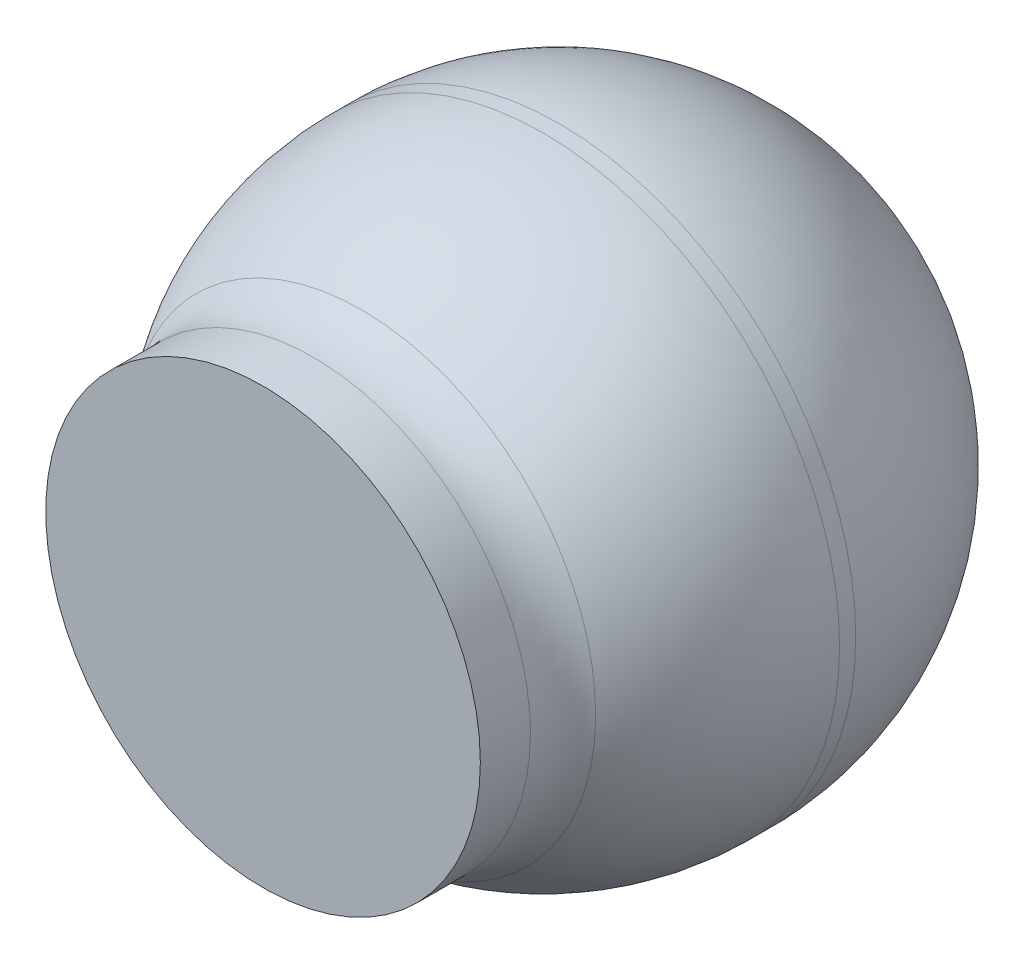
ISO-10303-21;
HEADER;
FILE_DESCRIPTION(('STEP AP214'),'2;1');
FILE_NAME('part.step','',(''),(''),'','','');
FILE_SCHEMA(('AUTOMOTIVE_DESIGN { 1 0 10303 214 1 1 1 1 }'));
ENDSEC;
DATA;
#1=APPLICATION_CONTEXT('core data for automotive mechanical design processes');
#2=APPLICATION_PROTOCOL_DEFINITION('international standard','automotive_design',2000,#1);
#3=PRODUCT_CONTEXT('',#1,'mechanical');
#4=PRODUCT('Part','Part','',(#3));
#5=PRODUCT_RELATED_PRODUCT_CATEGORY('part','',(#4));
#6=PRODUCT_DEFINITION_FORMATION('','',#4);
#7=PRODUCT_DEFINITION_CONTEXT('part definition',#1,'design');
#8=PRODUCT_DEFINITION('design','',#6,#7);
#9=PRODUCT_DEFINITION_SHAPE('','',#8);
#10=(LENGTH_UNIT() NAMED_UNIT(*) SI_UNIT(.MILLI.,.METRE.));
#11=(NAMED_UNIT(*) PLANE_ANGLE_UNIT() SI_UNIT($,.RADIAN.));
#12=(NAMED_UNIT(*) SI_UNIT($,.STERADIAN.) SOLID_ANGLE_UNIT());
#13=UNCERTAINTY_MEASURE_WITH_UNIT(LENGTH_MEASURE(1.E-05),#10,'distance_accuracy_value','');
#14=(GEOMETRIC_REPRESENTATION_CONTEXT(3) GLOBAL_UNCERTAINTY_ASSIGNED_CONTEXT((#13)) GLOBAL_UNIT_ASSIGNED_CONTEXT((#10,
#11,#12)) REPRESENTATION_CONTEXT('',''));
#15=CARTESIAN_POINT('',(0.,0.,0.));
#16=DIRECTION('',(0.,0.,1.));
#17=DIRECTION('',(1.,0.,0.));
#18=AXIS2_PLACEMENT_3D('',#15,#16,#17);
#19=CARTESIAN_POINT('',(-5.642919922269,-7.861349291452,10.006534503384));
#20=DIRECTION('',(0.,0.,-1.));
#21=DIRECTION('',(-1.,0.,0.));
#22=AXIS2_PLACEMENT_3D('',#19,#20,#21);
#23=PLANE('',#22);
#24=CARTESIAN_POINT('',(-5.642919922269,-7.861349291452,10.006534503384));
#25=DIRECTION('',(0.,0.,1.));
#26=DIRECTION('',(1.,0.,0.));
#27=AXIS2_PLACEMENT_3D('',#24,#25,#26);
#28=CIRCLE('',#27,0.275);
#29=CARTESIAN_POINT('',(-5.367919922269,-7.861349291452,10.006534503384));
#30=VERTEX_POINT('',#29);
#31=EDGE_CURVE('E20',#30,#30,#28,.F.);
#32=ORIENTED_EDGE('',*,*,#31,.F.);
#33=EDGE_LOOP('',(#32));
#34=FACE_BOUND('',#33,.T.);
#35=ADVANCED_FACE('F17',(#34),#23,.F.);
#36=CARTESIAN_POINT('',(-5.642919922269,-7.861349291452,9.906534503384));
#37=DIRECTION('',(0.,0.,1.));
#38=DIRECTION('',(1.,0.,0.));
#39=AXIS2_PLACEMENT_3D('',#36,#37,#38);
#40=CYLINDRICAL_SURFACE('',#39,0.275);
#41=CARTESIAN_POINT('',(-5.642919922269,-7.861349291452,9.943180457728));
#42=DIRECTION('',(0.,0.,-1.));
#43=DIRECTION('',(0.996700902337582,0.081162252799247,0.));
#44=AXIS2_PLACEMENT_3D('',#41,#42,#43);
#45=CIRCLE('',#44,0.275);
#46=CARTESIAN_POINT('',(-5.36882717412616,-7.83902967193221,9.943180457728));
#47=VERTEX_POINT('',#46);
#48=EDGE_CURVE('E65',#47,#47,#45,.F.);
#49=ORIENTED_EDGE('',*,*,#48,.T.);
#50=EDGE_LOOP('',(#49));
#51=FACE_BOUND('',#50,.T.);
#52=ORIENTED_EDGE('',*,*,#31,.T.);
#53=EDGE_LOOP('',(#52));
#54=FACE_BOUND('',#53,.T.);
#55=ADVANCED_FACE('F62',(#51,#54),#40,.T.);
#56=CARTESIAN_POINT('',(-5.642919922269,-7.861349291452,9.943180457728));
#57=DIRECTION('',(0.,0.,-1.));
#58=DIRECTION('',(0.996700902337583,0.0811622527992448,0.));
#59=AXIS2_PLACEMENT_3D('',#56,#57,#58);
#60=TOROIDAL_SURFACE('',#59,0.375,0.1);
#61=ORIENTED_EDGE('',*,*,#48,.F.);
#62=EDGE_LOOP('',(#61));
#63=FACE_BOUND('',#62,.T.);
#64=CARTESIAN_POINT('',(-5.642919922269,-7.861349291452,9.881744931236));
#65=DIRECTION('',(0.,0.,-1.));
#66=DIRECTION('',(-0.996700902337598,-0.081162252799062,0.));
#67=AXIS2_PLACEMENT_3D('',#64,#65,#66);
#68=CIRCLE('',#67,0.296097046412666);
#69=CARTESIAN_POINT('',(-5.938040115608,-7.885381194786,9.881744931236));
#70=VERTEX_POINT('',#69);
#71=EDGE_CURVE('E39',#70,#70,#68,.T.);
#72=ORIENTED_EDGE('',*,*,#71,.F.);
#73=EDGE_LOOP('',(#72));
#74=FACE_BOUND('',#73,.T.);
#75=ADVANCED_FACE('F57',(#63,#74),#60,.F.);
#76=CARTESIAN_POINT('',(-6.016682760645,-7.891785136252,9.651976062157));
#77=CARTESIAN_POINT('',(-6.016682760645,-7.891785136252,9.701461392103));
#78=CARTESIAN_POINT('',(-6.008526217348,-7.891120941579,9.750947004335));
#79=CARTESIAN_POINT('',(-5.992207085349,-7.889792059952,9.798626332798));
#80=CARTESIAN_POINT('',(-5.968341390838,-7.887848654938,9.842699544317));
#81=CARTESIAN_POINT('',(-5.938040115608,-7.885381194786,9.881744931236));
#82=(BOUNDED_CURVE() B_SPLINE_CURVE(5,(#76,#77,#78,#79,#80,#81),.UNSPECIFIED.,.F.,
.F.) B_SPLINE_CURVE_WITH_KNOTS((6,6),(0.,0.661568582165),
.UNSPECIFIED.) CURVE() GEOMETRIC_REPRESENTATION_ITEM() RATIONAL_B_SPLINE_CURVE((1.,1.,1.,1.,1.,1.)) REPRESENTATION_ITEM(''));
#83=CARTESIAN_POINT('',(-5.642919922269,-7.861349291452,9.651976062157));
#84=DIRECTION('',(0.,0.,-1.));
#85=AXIS1_PLACEMENT('',#83,#84);
#86=SURFACE_OF_REVOLUTION('',#82,#85);
#87=CARTESIAN_POINT('',(-5.642919922269,-7.861349291452,9.651976062157));
#88=DIRECTION('',(0.,0.,1.));
#89=DIRECTION('',(1.,0.,0.));
#90=AXIS2_PLACEMENT_3D('',#87,#88,#89);
#91=CIRCLE('',#90,0.375);
#92=CARTESIAN_POINT('',(-5.267919922269,-7.861349291452,9.651976062157));
#93=VERTEX_POINT('',#92);
#94=EDGE_CURVE('E36',#93,#93,#91,.F.);
#95=ORIENTED_EDGE('',*,*,#94,.F.);
#96=EDGE_LOOP('',(#95));
#97=FACE_BOUND('',#96,.T.);
#98=ORIENTED_EDGE('',*,*,#71,.T.);
#99=EDGE_LOOP('',(#98));
#100=FACE_BOUND('',#99,.T.);
#101=ADVANCED_FACE('F53',(#97,#100),#86,.F.);
#102=CARTESIAN_POINT('',(-5.642919922269,-7.861349291452,9.256534503384));
#103=DIRECTION('',(0.,0.,1.));
#104=DIRECTION('',(1.,0.,0.));
#105=AXIS2_PLACEMENT_3D('',#102,#103,#104);
#106=CYLINDRICAL_SURFACE('',#105,0.375);
#107=CARTESIAN_POINT('',(-5.642919922269,-7.861349291452,9.631534503384));
#108=DIRECTION('',(0.,0.,-1.));
#109=DIRECTION('',(0.0811622527992357,-0.996700902337583,0.));
#110=AXIS2_PLACEMENT_3D('',#107,#108,#109);
#111=CIRCLE('',#110,0.375);
#112=CARTESIAN_POINT('',(-5.61248407746929,-8.23511212982859,9.631534503384));
#113=VERTEX_POINT('',#112);
#114=CARTESIAN_POINT('',(-5.67335576706871,-7.48758645307541,9.631534503384));
#115=VERTEX_POINT('',#114);
#116=EDGE_CURVE('E11',#113,#115,#111,.T.);
#117=ORIENTED_EDGE('',*,*,#116,.F.);
#118=CARTESIAN_POINT('',(-5.642919922269,-7.861349291452,9.631534503384));
#119=DIRECTION('',(0.,0.,1.));
#120=DIRECTION('',(0.0811622527992365,-0.996700902337583,0.));
#121=AXIS2_PLACEMENT_3D('',#118,#119,#120);
#122=CIRCLE('',#121,0.375);
#123=EDGE_CURVE('E25',#115,#113,#122,.F.);
#124=ORIENTED_EDGE('',*,*,#123,.F.);
#125=EDGE_LOOP('',(#117,#124));
#126=FACE_BOUND('',#125,.T.);
#127=ORIENTED_EDGE('',*,*,#94,.T.);
#128=EDGE_LOOP('',(#127));
#129=FACE_BOUND('',#128,.T.);
#130=ADVANCED_FACE('F34',(#126,#129),#106,.T.);
#131=CARTESIAN_POINT('',(-5.642919922269,-7.861349291452,9.631534503384));
#132=DIRECTION('',(0.0811622527992361,-0.996700902337583,0.));
#133=DIRECTION('',(-0.996700902337583,-0.0811622527992361,0.));
#134=AXIS2_PLACEMENT_3D('',#131,#132,#133);
#135=SPHERICAL_SURFACE('',#134,0.375);
#136=ORIENTED_EDGE('',*,*,#123,.T.);
#137=ORIENTED_EDGE('',*,*,#116,.T.);
#138=EDGE_LOOP('',(#136,#137));
#139=FACE_BOUND('',#138,.T.);
#140=ADVANCED_FACE('F32',(#139),#135,.T.);
#141=CLOSED_SHELL('',(#35,#55,#75,#101,#130,#140));
#142=MANIFOLD_SOLID_BREP('B1',#141);
#143=ADVANCED_BREP_SHAPE_REPRESENTATION('',(#18,#142),#14);
#144=SHAPE_DEFINITION_REPRESENTATION(#9,#143);
ENDSEC;
END-ISO-10303-21;
